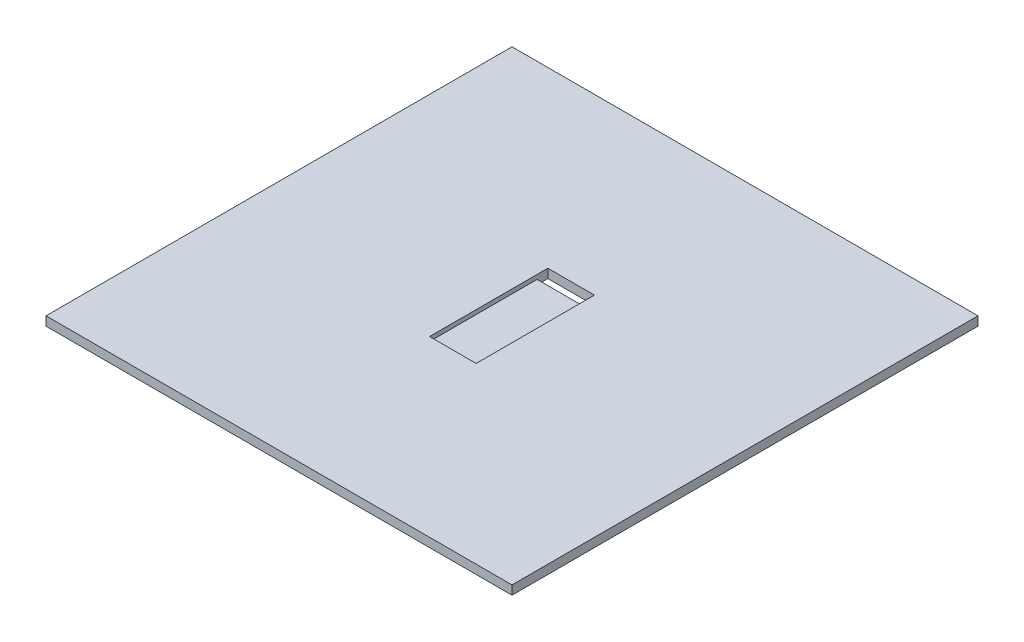
ISO-10303-21;
HEADER;
FILE_DESCRIPTION(('STEP AP214'),'2;1');
FILE_NAME('part.step','',(''),(''),'','','');
FILE_SCHEMA(('AUTOMOTIVE_DESIGN { 1 0 10303 214 1 1 1 1 }'));
ENDSEC;
DATA;
#1=APPLICATION_CONTEXT('core data for automotive mechanical design processes');
#2=APPLICATION_PROTOCOL_DEFINITION('international standard','automotive_design',2000,#1);
#3=PRODUCT_CONTEXT('',#1,'mechanical');
#4=PRODUCT('Part','Part','',(#3));
#5=PRODUCT_RELATED_PRODUCT_CATEGORY('part','',(#4));
#6=PRODUCT_DEFINITION_FORMATION('','',#4);
#7=PRODUCT_DEFINITION_CONTEXT('part definition',#1,'design');
#8=PRODUCT_DEFINITION('design','',#6,#7);
#9=PRODUCT_DEFINITION_SHAPE('','',#8);
#10=(LENGTH_UNIT() NAMED_UNIT(*) SI_UNIT(.MILLI.,.METRE.));
#11=(NAMED_UNIT(*) PLANE_ANGLE_UNIT() SI_UNIT($,.RADIAN.));
#12=(NAMED_UNIT(*) SI_UNIT($,.STERADIAN.) SOLID_ANGLE_UNIT());
#13=UNCERTAINTY_MEASURE_WITH_UNIT(LENGTH_MEASURE(1.E-05),#10,'distance_accuracy_value','');
#14=(GEOMETRIC_REPRESENTATION_CONTEXT(3) GLOBAL_UNCERTAINTY_ASSIGNED_CONTEXT((#13)) GLOBAL_UNIT_ASSIGNED_CONTEXT((#10,
#11,#12)) REPRESENTATION_CONTEXT('',''));
#15=CARTESIAN_POINT('',(0.,0.,0.));
#16=DIRECTION('',(0.,0.,1.));
#17=DIRECTION('',(1.,0.,0.));
#18=AXIS2_PLACEMENT_3D('',#15,#16,#17);
#19=CARTESIAN_POINT('',(0.,1.3,0.));
#20=DIRECTION('',(0.,-1.,0.));
#21=DIRECTION('',(0.,0.,-1.));
#22=AXIS2_PLACEMENT_3D('',#19,#20,#21);
#23=PLANE('',#22);
#24=DIRECTION('',(1.,0.,0.));
#25=VECTOR('',#24,1.);
#26=CARTESIAN_POINT('',(-6.5,1.3,-13.5));
#27=LINE('',#26,#25);
#28=CARTESIAN_POINT('',(-6.5,1.3,-13.5));
#29=VERTEX_POINT('',#28);
#30=CARTESIAN_POINT('',(6.5,1.3,-13.5));
#31=VERTEX_POINT('',#30);
#32=EDGE_CURVE('E141',#29,#31,#27,.T.);
#33=ORIENTED_EDGE('',*,*,#32,.F.);
#34=DIRECTION('',(0.,0.,1.));
#35=VECTOR('',#34,1.);
#36=CARTESIAN_POINT('',(-6.5,1.3,16.5));
#37=LINE('',#36,#35);
#38=CARTESIAN_POINT('',(-6.5,1.3,16.5));
#39=VERTEX_POINT('',#38);
#40=EDGE_CURVE('E159',#29,#39,#37,.T.);
#41=ORIENTED_EDGE('',*,*,#40,.T.);
#42=DIRECTION('',(1.,0.,0.));
#43=VECTOR('',#42,1.);
#44=CARTESIAN_POINT('',(-6.5,1.3,16.5));
#45=LINE('',#44,#43);
#46=CARTESIAN_POINT('',(6.5,1.3,16.5));
#47=VERTEX_POINT('',#46);
#48=EDGE_CURVE('E127',#39,#47,#45,.T.);
#49=ORIENTED_EDGE('',*,*,#48,.T.);
#50=DIRECTION('',(0.,0.,-1.));
#51=VECTOR('',#50,1.);
#52=CARTESIAN_POINT('',(6.5,1.3,16.5));
#53=LINE('',#52,#51);
#54=EDGE_CURVE('E155',#47,#31,#53,.T.);
#55=ORIENTED_EDGE('',*,*,#54,.T.);
#56=EDGE_LOOP('',(#33,#41,#49,#55));
#57=FACE_BOUND('',#56,.T.);
#58=ADVANCED_FACE('F38',(#57),#23,.F.);
#59=CARTESIAN_POINT('',(65.,2.5,65.));
#60=DIRECTION('',(-1.,0.,0.));
#61=DIRECTION('',(0.,0.,1.));
#62=AXIS2_PLACEMENT_3D('',#59,#60,#61);
#63=PLANE('',#62);
#64=DIRECTION('',(0.,0.,-1.));
#65=VECTOR('',#64,1.);
#66=CARTESIAN_POINT('',(65.,0.,65.));
#67=LINE('',#66,#65);
#68=CARTESIAN_POINT('',(65.,0.,65.));
#69=VERTEX_POINT('',#68);
#70=CARTESIAN_POINT('',(65.,0.,-65.));
#71=VERTEX_POINT('',#70);
#72=EDGE_CURVE('E181',#69,#71,#67,.T.);
#73=ORIENTED_EDGE('',*,*,#72,.T.);
#74=DIRECTION('',(0.,-1.,0.));
#75=VECTOR('',#74,1.);
#76=CARTESIAN_POINT('',(65.,2.5,-65.));
#77=LINE('',#76,#75);
#78=CARTESIAN_POINT('',(65.,2.5,-65.));
#79=VERTEX_POINT('',#78);
#80=EDGE_CURVE('E11',#79,#71,#77,.T.);
#81=ORIENTED_EDGE('',*,*,#80,.F.);
#82=DIRECTION('',(0.,0.,-1.));
#83=VECTOR('',#82,1.);
#84=CARTESIAN_POINT('',(65.,2.5,65.));
#85=LINE('',#84,#83);
#86=CARTESIAN_POINT('',(65.,2.5,65.));
#87=VERTEX_POINT('',#86);
#88=EDGE_CURVE('E187',#87,#79,#85,.T.);
#89=ORIENTED_EDGE('',*,*,#88,.F.);
#90=DIRECTION('',(0.,-1.,0.));
#91=VECTOR('',#90,1.);
#92=CARTESIAN_POINT('',(65.,2.5,65.));
#93=LINE('',#92,#91);
#94=EDGE_CURVE('E201',#87,#69,#93,.T.);
#95=ORIENTED_EDGE('',*,*,#94,.T.);
#96=EDGE_LOOP('',(#73,#81,#89,#95));
#97=FACE_BOUND('',#96,.T.);
#98=ADVANCED_FACE('F40',(#97),#63,.F.);
#99=CARTESIAN_POINT('',(-65.,2.5,-65.));
#100=DIRECTION('',(0.,0.,1.));
#101=DIRECTION('',(1.,0.,0.));
#102=AXIS2_PLACEMENT_3D('',#99,#100,#101);
#103=PLANE('',#102);
#104=DIRECTION('',(-1.,0.,0.));
#105=VECTOR('',#104,1.);
#106=CARTESIAN_POINT('',(-65.,0.,-65.));
#107=LINE('',#106,#105);
#108=CARTESIAN_POINT('',(-65.,0.,-65.));
#109=VERTEX_POINT('',#108);
#110=EDGE_CURVE('E205',#71,#109,#107,.T.);
#111=ORIENTED_EDGE('',*,*,#110,.T.);
#112=DIRECTION('',(0.,-1.,0.));
#113=VECTOR('',#112,1.);
#114=CARTESIAN_POINT('',(-65.,2.5,-65.));
#115=LINE('',#114,#113);
#116=CARTESIAN_POINT('',(-65.,2.5,-65.));
#117=VERTEX_POINT('',#116);
#118=EDGE_CURVE('E47',#117,#109,#115,.T.);
#119=ORIENTED_EDGE('',*,*,#118,.F.);
#120=DIRECTION('',(-1.,0.,0.));
#121=VECTOR('',#120,1.);
#122=CARTESIAN_POINT('',(-65.,2.5,-65.));
#123=LINE('',#122,#121);
#124=EDGE_CURVE('E191',#79,#117,#123,.T.);
#125=ORIENTED_EDGE('',*,*,#124,.F.);
#126=ORIENTED_EDGE('',*,*,#80,.T.);
#127=EDGE_LOOP('',(#111,#119,#125,#126));
#128=FACE_BOUND('',#127,.T.);
#129=ADVANCED_FACE('F239',(#128),#103,.F.);
#130=CARTESIAN_POINT('',(-65.,2.5,65.));
#131=DIRECTION('',(1.,0.,0.));
#132=DIRECTION('',(0.,0.,-1.));
#133=AXIS2_PLACEMENT_3D('',#130,#131,#132);
#134=PLANE('',#133);
#135=DIRECTION('',(0.,0.,1.));
#136=VECTOR('',#135,1.);
#137=CARTESIAN_POINT('',(-65.,0.,65.));
#138=LINE('',#137,#136);
#139=CARTESIAN_POINT('',(-65.,0.,65.));
#140=VERTEX_POINT('',#139);
#141=EDGE_CURVE('E208',#109,#140,#138,.T.);
#142=ORIENTED_EDGE('',*,*,#141,.T.);
#143=DIRECTION('',(0.,-1.,0.));
#144=VECTOR('',#143,1.);
#145=CARTESIAN_POINT('',(-65.,2.5,65.));
#146=LINE('',#145,#144);
#147=CARTESIAN_POINT('',(-65.,2.5,65.));
#148=VERTEX_POINT('',#147);
#149=EDGE_CURVE('E216',#148,#140,#146,.T.);
#150=ORIENTED_EDGE('',*,*,#149,.F.);
#151=DIRECTION('',(0.,0.,1.));
#152=VECTOR('',#151,1.);
#153=CARTESIAN_POINT('',(-65.,2.5,65.));
#154=LINE('',#153,#152);
#155=EDGE_CURVE('E195',#117,#148,#154,.T.);
#156=ORIENTED_EDGE('',*,*,#155,.F.);
#157=ORIENTED_EDGE('',*,*,#118,.T.);
#158=EDGE_LOOP('',(#142,#150,#156,#157));
#159=FACE_BOUND('',#158,.T.);
#160=ADVANCED_FACE('F225',(#159),#134,.F.);
#161=CARTESIAN_POINT('',(-65.,2.5,65.));
#162=DIRECTION('',(0.,0.,-1.));
#163=DIRECTION('',(-1.,0.,0.));
#164=AXIS2_PLACEMENT_3D('',#161,#162,#163);
#165=PLANE('',#164);
#166=DIRECTION('',(1.,0.,0.));
#167=VECTOR('',#166,1.);
#168=CARTESIAN_POINT('',(-65.,0.,65.));
#169=LINE('',#168,#167);
#170=EDGE_CURVE('E192',#140,#69,#169,.T.);
#171=ORIENTED_EDGE('',*,*,#170,.T.);
#172=ORIENTED_EDGE('',*,*,#94,.F.);
#173=DIRECTION('',(1.,0.,0.));
#174=VECTOR('',#173,1.);
#175=CARTESIAN_POINT('',(-65.,2.5,65.));
#176=LINE('',#175,#174);
#177=EDGE_CURVE('E198',#148,#87,#176,.T.);
#178=ORIENTED_EDGE('',*,*,#177,.F.);
#179=ORIENTED_EDGE('',*,*,#149,.T.);
#180=EDGE_LOOP('',(#171,#172,#178,#179));
#181=FACE_BOUND('',#180,.T.);
#182=ADVANCED_FACE('F232',(#181),#165,.F.);
#183=CARTESIAN_POINT('',(0.,2.5,0.));
#184=DIRECTION('',(0.,-1.,0.));
#185=DIRECTION('',(0.,0.,-1.));
#186=AXIS2_PLACEMENT_3D('',#183,#184,#185);
#187=PLANE('',#186);
#188=DIRECTION('',(-1.,0.,0.));
#189=VECTOR('',#188,1.);
#190=CARTESIAN_POINT('',(-6.5,2.5,-16.5));
#191=LINE('',#190,#189);
#192=CARTESIAN_POINT('',(6.5,2.5,-16.5));
#193=VERTEX_POINT('',#192);
#194=CARTESIAN_POINT('',(-6.5,2.5,-16.5));
#195=VERTEX_POINT('',#194);
#196=EDGE_CURVE('E168',#193,#195,#191,.T.);
#197=ORIENTED_EDGE('',*,*,#196,.F.);
#198=DIRECTION('',(0.,0.,-1.));
#199=VECTOR('',#198,1.);
#200=CARTESIAN_POINT('',(6.5,2.5,16.5));
#201=LINE('',#200,#199);
#202=CARTESIAN_POINT('',(6.5,2.5,16.5));
#203=VERTEX_POINT('',#202);
#204=EDGE_CURVE('E124',#203,#193,#201,.T.);
#205=ORIENTED_EDGE('',*,*,#204,.F.);
#206=DIRECTION('',(1.,0.,0.));
#207=VECTOR('',#206,1.);
#208=CARTESIAN_POINT('',(-6.5,2.5,16.5));
#209=LINE('',#208,#207);
#210=CARTESIAN_POINT('',(-6.5,2.5,16.5));
#211=VERTEX_POINT('',#210);
#212=EDGE_CURVE('E160',#211,#203,#209,.T.);
#213=ORIENTED_EDGE('',*,*,#212,.F.);
#214=DIRECTION('',(0.,0.,1.));
#215=VECTOR('',#214,1.);
#216=CARTESIAN_POINT('',(-6.5,2.5,16.5));
#217=LINE('',#216,#215);
#218=EDGE_CURVE('E171',#195,#211,#217,.T.);
#219=ORIENTED_EDGE('',*,*,#218,.F.);
#220=EDGE_LOOP('',(#197,#205,#213,#219));
#221=FACE_BOUND('',#220,.T.);
#222=ORIENTED_EDGE('',*,*,#88,.T.);
#223=ORIENTED_EDGE('',*,*,#124,.T.);
#224=ORIENTED_EDGE('',*,*,#155,.T.);
#225=ORIENTED_EDGE('',*,*,#177,.T.);
#226=EDGE_LOOP('',(#222,#223,#224,#225));
#227=FACE_BOUND('',#226,.T.);
#228=ADVANCED_FACE('F238',(#221,#227),#187,.F.);
#229=CARTESIAN_POINT('',(0.,0.,0.));
#230=DIRECTION('',(0.,-1.,0.));
#231=DIRECTION('',(0.,0.,-1.));
#232=AXIS2_PLACEMENT_3D('',#229,#230,#231);
#233=PLANE('',#232);
#234=DIRECTION('',(0.,0.,-1.));
#235=VECTOR('',#234,1.);
#236=CARTESIAN_POINT('',(6.5,0.,-13.5));
#237=LINE('',#236,#235);
#238=CARTESIAN_POINT('',(6.5,0.,-13.5));
#239=VERTEX_POINT('',#238);
#240=CARTESIAN_POINT('',(6.5,0.,-16.5));
#241=VERTEX_POINT('',#240);
#242=EDGE_CURVE('E121',#239,#241,#237,.T.);
#243=ORIENTED_EDGE('',*,*,#242,.T.);
#244=DIRECTION('',(-1.,0.,0.));
#245=VECTOR('',#244,1.);
#246=CARTESIAN_POINT('',(-6.5,0.,-16.5));
#247=LINE('',#246,#245);
#248=CARTESIAN_POINT('',(-6.5,0.,-16.5));
#249=VERTEX_POINT('',#248);
#250=EDGE_CURVE('E130',#241,#249,#247,.T.);
#251=ORIENTED_EDGE('',*,*,#250,.T.);
#252=DIRECTION('',(0.,0.,1.));
#253=VECTOR('',#252,1.);
#254=CARTESIAN_POINT('',(-6.5,0.,-13.5));
#255=LINE('',#254,#253);
#256=CARTESIAN_POINT('',(-6.5,0.,-13.5));
#257=VERTEX_POINT('',#256);
#258=EDGE_CURVE('E135',#249,#257,#255,.T.);
#259=ORIENTED_EDGE('',*,*,#258,.T.);
#260=DIRECTION('',(1.,0.,0.));
#261=VECTOR('',#260,1.);
#262=CARTESIAN_POINT('',(-6.5,0.,-13.5));
#263=LINE('',#262,#261);
#264=EDGE_CURVE('E139',#257,#239,#263,.T.);
#265=ORIENTED_EDGE('',*,*,#264,.T.);
#266=EDGE_LOOP('',(#243,#251,#259,#265));
#267=FACE_BOUND('',#266,.T.);
#268=ORIENTED_EDGE('',*,*,#72,.F.);
#269=ORIENTED_EDGE('',*,*,#170,.F.);
#270=ORIENTED_EDGE('',*,*,#141,.F.);
#271=ORIENTED_EDGE('',*,*,#110,.F.);
#272=EDGE_LOOP('',(#268,#269,#270,#271));
#273=FACE_BOUND('',#272,.T.);
#274=ADVANCED_FACE('F137',(#267,#273),#233,.T.);
#275=CARTESIAN_POINT('',(6.5,1.3,16.5));
#276=DIRECTION('',(1.,0.,0.));
#277=DIRECTION('',(0.,0.,-1.));
#278=AXIS2_PLACEMENT_3D('',#275,#276,#277);
#279=PLANE('',#278);
#280=ORIENTED_EDGE('',*,*,#204,.T.);
#281=DIRECTION('',(0.,1.,0.));
#282=VECTOR('',#281,1.);
#283=CARTESIAN_POINT('',(6.5,1.3,-16.5));
#284=LINE('',#283,#282);
#285=EDGE_CURVE('E118',#241,#193,#284,.T.);
#286=ORIENTED_EDGE('',*,*,#285,.F.);
#287=ORIENTED_EDGE('',*,*,#242,.F.);
#288=DIRECTION('',(0.,1.,0.));
#289=VECTOR('',#288,1.);
#290=CARTESIAN_POINT('',(6.5,0.,-13.5));
#291=LINE('',#290,#289);
#292=EDGE_CURVE('E150',#239,#31,#291,.T.);
#293=ORIENTED_EDGE('',*,*,#292,.T.);
#294=ORIENTED_EDGE('',*,*,#54,.F.);
#295=DIRECTION('',(0.,1.,0.));
#296=VECTOR('',#295,1.);
#297=CARTESIAN_POINT('',(6.5,1.3,16.5));
#298=LINE('',#297,#296);
#299=EDGE_CURVE('E178',#47,#203,#298,.T.);
#300=ORIENTED_EDGE('',*,*,#299,.T.);
#301=EDGE_LOOP('',(#280,#286,#287,#293,#294,#300));
#302=FACE_BOUND('',#301,.T.);
#303=ADVANCED_FACE('F119',(#302),#279,.F.);
#304=CARTESIAN_POINT('',(-6.5,1.3,16.5));
#305=DIRECTION('',(0.,0.,1.));
#306=DIRECTION('',(1.,0.,0.));
#307=AXIS2_PLACEMENT_3D('',#304,#305,#306);
#308=PLANE('',#307);
#309=ORIENTED_EDGE('',*,*,#212,.T.);
#310=ORIENTED_EDGE('',*,*,#299,.F.);
#311=ORIENTED_EDGE('',*,*,#48,.F.);
#312=DIRECTION('',(0.,1.,0.));
#313=VECTOR('',#312,1.);
#314=CARTESIAN_POINT('',(-6.5,1.3,16.5));
#315=LINE('',#314,#313);
#316=EDGE_CURVE('E182',#39,#211,#315,.T.);
#317=ORIENTED_EDGE('',*,*,#316,.T.);
#318=EDGE_LOOP('',(#309,#310,#311,#317));
#319=FACE_BOUND('',#318,.T.);
#320=ADVANCED_FACE('F256',(#319),#308,.F.);
#321=CARTESIAN_POINT('',(-6.5,1.3,16.5));
#322=DIRECTION('',(-1.,0.,0.));
#323=DIRECTION('',(0.,0.,1.));
#324=AXIS2_PLACEMENT_3D('',#321,#322,#323);
#325=PLANE('',#324);
#326=ORIENTED_EDGE('',*,*,#218,.T.);
#327=ORIENTED_EDGE('',*,*,#316,.F.);
#328=ORIENTED_EDGE('',*,*,#40,.F.);
#329=DIRECTION('',(0.,1.,0.));
#330=VECTOR('',#329,1.);
#331=CARTESIAN_POINT('',(-6.5,0.,-13.5));
#332=LINE('',#331,#330);
#333=EDGE_CURVE('E54',#257,#29,#332,.T.);
#334=ORIENTED_EDGE('',*,*,#333,.F.);
#335=ORIENTED_EDGE('',*,*,#258,.F.);
#336=DIRECTION('',(0.,1.,0.));
#337=VECTOR('',#336,1.);
#338=CARTESIAN_POINT('',(-6.5,1.3,-16.5));
#339=LINE('',#338,#337);
#340=EDGE_CURVE('E62',#249,#195,#339,.T.);
#341=ORIENTED_EDGE('',*,*,#340,.T.);
#342=EDGE_LOOP('',(#326,#327,#328,#334,#335,#341));
#343=FACE_BOUND('',#342,.T.);
#344=ADVANCED_FACE('F259',(#343),#325,.F.);
#345=CARTESIAN_POINT('',(-6.5,1.3,-16.5));
#346=DIRECTION('',(0.,0.,-1.));
#347=DIRECTION('',(-1.,0.,0.));
#348=AXIS2_PLACEMENT_3D('',#345,#346,#347);
#349=PLANE('',#348);
#350=ORIENTED_EDGE('',*,*,#196,.T.);
#351=ORIENTED_EDGE('',*,*,#340,.F.);
#352=ORIENTED_EDGE('',*,*,#250,.F.);
#353=ORIENTED_EDGE('',*,*,#285,.T.);
#354=EDGE_LOOP('',(#350,#351,#352,#353));
#355=FACE_BOUND('',#354,.T.);
#356=ADVANCED_FACE('F131',(#355),#349,.F.);
#357=CARTESIAN_POINT('',(-6.5,0.,-13.5));
#358=DIRECTION('',(0.,0.,1.));
#359=DIRECTION('',(1.,0.,0.));
#360=AXIS2_PLACEMENT_3D('',#357,#358,#359);
#361=PLANE('',#360);
#362=ORIENTED_EDGE('',*,*,#32,.T.);
#363=ORIENTED_EDGE('',*,*,#292,.F.);
#364=ORIENTED_EDGE('',*,*,#264,.F.);
#365=ORIENTED_EDGE('',*,*,#333,.T.);
#366=EDGE_LOOP('',(#362,#363,#364,#365));
#367=FACE_BOUND('',#366,.T.);
#368=ADVANCED_FACE('F255',(#367),#361,.F.);
#369=CLOSED_SHELL('',(#58,#98,#129,#160,#182,#228,#274,#303,#320,#344,#356,#368));
#370=MANIFOLD_SOLID_BREP('B2',#369);
#371=ADVANCED_BREP_SHAPE_REPRESENTATION('',(#18,#370),#14);
#372=SHAPE_DEFINITION_REPRESENTATION(#9,#371);
ENDSEC;
END-ISO-10303-21;
